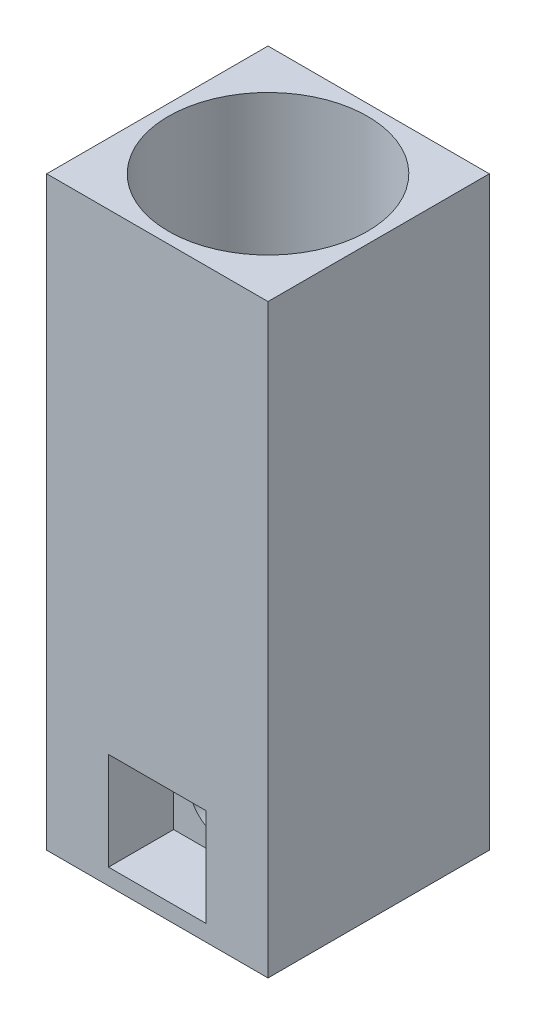
ISO-10303-21;
HEADER;
FILE_DESCRIPTION(('STEP AP214'),'2;1');
FILE_NAME('part.step','',(''),(''),'','','');
FILE_SCHEMA(('AUTOMOTIVE_DESIGN { 1 0 10303 214 1 1 1 1 }'));
ENDSEC;
DATA;
#1=APPLICATION_CONTEXT('core data for automotive mechanical design processes');
#2=APPLICATION_PROTOCOL_DEFINITION('international standard','automotive_design',2000,#1);
#3=PRODUCT_CONTEXT('',#1,'mechanical');
#4=PRODUCT('Part','Part','',(#3));
#5=PRODUCT_RELATED_PRODUCT_CATEGORY('part','',(#4));
#6=PRODUCT_DEFINITION_FORMATION('','',#4);
#7=PRODUCT_DEFINITION_CONTEXT('part definition',#1,'design');
#8=PRODUCT_DEFINITION('design','',#6,#7);
#9=PRODUCT_DEFINITION_SHAPE('','',#8);
#10=(LENGTH_UNIT() NAMED_UNIT(*) SI_UNIT(.MILLI.,.METRE.));
#11=(NAMED_UNIT(*) PLANE_ANGLE_UNIT() SI_UNIT($,.RADIAN.));
#12=(NAMED_UNIT(*) SI_UNIT($,.STERADIAN.) SOLID_ANGLE_UNIT());
#13=UNCERTAINTY_MEASURE_WITH_UNIT(LENGTH_MEASURE(1.E-05),#10,'distance_accuracy_value','');
#14=(GEOMETRIC_REPRESENTATION_CONTEXT(3) GLOBAL_UNCERTAINTY_ASSIGNED_CONTEXT((#13)) GLOBAL_UNIT_ASSIGNED_CONTEXT((#10,
#11,#12)) REPRESENTATION_CONTEXT('',''));
#15=CARTESIAN_POINT('',(0.,0.,0.));
#16=DIRECTION('',(0.,0.,1.));
#17=DIRECTION('',(1.,0.,0.));
#18=AXIS2_PLACEMENT_3D('',#15,#16,#17);
#19=CARTESIAN_POINT('',(10.795,57.15,10.795));
#20=DIRECTION('',(-1.,0.,0.));
#21=DIRECTION('',(0.,0.,1.));
#22=AXIS2_PLACEMENT_3D('',#19,#20,#21);
#23=PLANE('',#22);
#24=DIRECTION('',(0.,0.,-1.));
#25=VECTOR('',#24,1.);
#26=CARTESIAN_POINT('',(10.795,0.,10.795));
#27=LINE('',#26,#25);
#28=CARTESIAN_POINT('',(10.795,0.,10.795));
#29=VERTEX_POINT('',#28);
#30=CARTESIAN_POINT('',(10.795,0.,-10.795));
#31=VERTEX_POINT('',#30);
#32=EDGE_CURVE('E162',#29,#31,#27,.T.);
#33=ORIENTED_EDGE('',*,*,#32,.T.);
#34=DIRECTION('',(0.,-1.,0.));
#35=VECTOR('',#34,1.);
#36=CARTESIAN_POINT('',(10.795,57.15,-10.795));
#37=LINE('',#36,#35);
#38=CARTESIAN_POINT('',(10.795,57.15,-10.795));
#39=VERTEX_POINT('',#38);
#40=EDGE_CURVE('E11',#39,#31,#37,.T.);
#41=ORIENTED_EDGE('',*,*,#40,.F.);
#42=DIRECTION('',(0.,0.,-1.));
#43=VECTOR('',#42,1.);
#44=CARTESIAN_POINT('',(10.795,57.15,10.795));
#45=LINE('',#44,#43);
#46=CARTESIAN_POINT('',(10.795,57.15,10.795));
#47=VERTEX_POINT('',#46);
#48=EDGE_CURVE('E168',#47,#39,#45,.T.);
#49=ORIENTED_EDGE('',*,*,#48,.F.);
#50=DIRECTION('',(0.,-1.,0.));
#51=VECTOR('',#50,1.);
#52=CARTESIAN_POINT('',(10.795,57.15,10.795));
#53=LINE('',#52,#51);
#54=EDGE_CURVE('E178',#47,#29,#53,.T.);
#55=ORIENTED_EDGE('',*,*,#54,.T.);
#56=EDGE_LOOP('',(#33,#41,#49,#55));
#57=FACE_BOUND('',#56,.T.);
#58=ADVANCED_FACE('F39',(#57),#23,.F.);
#59=CARTESIAN_POINT('',(-10.795,57.15,-10.795));
#60=DIRECTION('',(0.,0.,1.));
#61=DIRECTION('',(1.,0.,0.));
#62=AXIS2_PLACEMENT_3D('',#59,#60,#61);
#63=PLANE('',#62);
#64=CARTESIAN_POINT('',(0.,6.35,-10.795));
#65=DIRECTION('',(0.,0.,1.));
#66=DIRECTION('',(1.,0.,0.));
#67=AXIS2_PLACEMENT_3D('',#64,#65,#66);
#68=CIRCLE('',#67,3.302);
#69=CARTESIAN_POINT('',(3.302,6.35,-10.795));
#70=VERTEX_POINT('',#69);
#71=EDGE_CURVE('E153',#70,#70,#68,.T.);
#72=ORIENTED_EDGE('',*,*,#71,.T.);
#73=EDGE_LOOP('',(#72));
#74=FACE_BOUND('',#73,.T.);
#75=DIRECTION('',(-1.,0.,0.));
#76=VECTOR('',#75,1.);
#77=CARTESIAN_POINT('',(-10.795,0.,-10.795));
#78=LINE('',#77,#76);
#79=CARTESIAN_POINT('',(-10.795,0.,-10.795));
#80=VERTEX_POINT('',#79);
#81=EDGE_CURVE('E182',#31,#80,#78,.T.);
#82=ORIENTED_EDGE('',*,*,#81,.T.);
#83=DIRECTION('',(0.,-1.,0.));
#84=VECTOR('',#83,1.);
#85=CARTESIAN_POINT('',(-10.795,57.15,-10.795));
#86=LINE('',#85,#84);
#87=CARTESIAN_POINT('',(-10.795,57.15,-10.795));
#88=VERTEX_POINT('',#87);
#89=EDGE_CURVE('E47',#88,#80,#86,.T.);
#90=ORIENTED_EDGE('',*,*,#89,.F.);
#91=DIRECTION('',(-1.,0.,0.));
#92=VECTOR('',#91,1.);
#93=CARTESIAN_POINT('',(-10.795,57.15,-10.795));
#94=LINE('',#93,#92);
#95=EDGE_CURVE('E91',#39,#88,#94,.T.);
#96=ORIENTED_EDGE('',*,*,#95,.F.);
#97=ORIENTED_EDGE('',*,*,#40,.T.);
#98=EDGE_LOOP('',(#82,#90,#96,#97));
#99=FACE_BOUND('',#98,.T.);
#100=ADVANCED_FACE('F218',(#74,#99),#63,.F.);
#101=CARTESIAN_POINT('',(-10.795,57.15,10.795));
#102=DIRECTION('',(1.,0.,0.));
#103=DIRECTION('',(0.,0.,-1.));
#104=AXIS2_PLACEMENT_3D('',#101,#102,#103);
#105=PLANE('',#104);
#106=DIRECTION('',(0.,0.,1.));
#107=VECTOR('',#106,1.);
#108=CARTESIAN_POINT('',(-10.795,0.,10.795));
#109=LINE('',#108,#107);
#110=CARTESIAN_POINT('',(-10.795,0.,10.795));
#111=VERTEX_POINT('',#110);
#112=EDGE_CURVE('E185',#80,#111,#109,.T.);
#113=ORIENTED_EDGE('',*,*,#112,.T.);
#114=DIRECTION('',(0.,-1.,0.));
#115=VECTOR('',#114,1.);
#116=CARTESIAN_POINT('',(-10.795,57.15,10.795));
#117=LINE('',#116,#115);
#118=CARTESIAN_POINT('',(-10.795,57.15,10.795));
#119=VERTEX_POINT('',#118);
#120=EDGE_CURVE('E192',#119,#111,#117,.T.);
#121=ORIENTED_EDGE('',*,*,#120,.F.);
#122=DIRECTION('',(0.,0.,1.));
#123=VECTOR('',#122,1.);
#124=CARTESIAN_POINT('',(-10.795,57.15,10.795));
#125=LINE('',#124,#123);
#126=EDGE_CURVE('E173',#88,#119,#125,.T.);
#127=ORIENTED_EDGE('',*,*,#126,.F.);
#128=ORIENTED_EDGE('',*,*,#89,.T.);
#129=EDGE_LOOP('',(#113,#121,#127,#128));
#130=FACE_BOUND('',#129,.T.);
#131=ADVANCED_FACE('F199',(#130),#105,.F.);
#132=CARTESIAN_POINT('',(-10.795,57.15,10.795));
#133=DIRECTION('',(0.,0.,-1.));
#134=DIRECTION('',(-1.,0.,0.));
#135=AXIS2_PLACEMENT_3D('',#132,#133,#134);
#136=PLANE('',#135);
#137=DIRECTION('',(-1.,0.,0.));
#138=VECTOR('',#137,1.);
#139=CARTESIAN_POINT('',(-4.7625,11.1125,10.795));
#140=LINE('',#139,#138);
#141=CARTESIAN_POINT('',(4.7625,11.1125,10.795));
#142=VERTEX_POINT('',#141);
#143=CARTESIAN_POINT('',(-4.7625,11.1125,10.795));
#144=VERTEX_POINT('',#143);
#145=EDGE_CURVE('E152',#142,#144,#140,.T.);
#146=ORIENTED_EDGE('',*,*,#145,.F.);
#147=DIRECTION('',(0.,1.,0.));
#148=VECTOR('',#147,1.);
#149=CARTESIAN_POINT('',(4.7625,1.5875,10.795));
#150=LINE('',#149,#148);
#151=CARTESIAN_POINT('',(4.7625,1.5875,10.795));
#152=VERTEX_POINT('',#151);
#153=EDGE_CURVE('E54',#152,#142,#150,.T.);
#154=ORIENTED_EDGE('',*,*,#153,.F.);
#155=DIRECTION('',(1.,0.,0.));
#156=VECTOR('',#155,1.);
#157=CARTESIAN_POINT('',(-4.7625,1.5875,10.795));
#158=LINE('',#157,#156);
#159=CARTESIAN_POINT('',(-4.7625,1.5875,10.795));
#160=VERTEX_POINT('',#159);
#161=EDGE_CURVE('E136',#160,#152,#158,.T.);
#162=ORIENTED_EDGE('',*,*,#161,.F.);
#163=DIRECTION('',(0.,-1.,0.));
#164=VECTOR('',#163,1.);
#165=CARTESIAN_POINT('',(-4.7625,1.5875,10.795));
#166=LINE('',#165,#164);
#167=EDGE_CURVE('E140',#144,#160,#166,.T.);
#168=ORIENTED_EDGE('',*,*,#167,.F.);
#169=EDGE_LOOP('',(#146,#154,#162,#168));
#170=FACE_BOUND('',#169,.T.);
#171=DIRECTION('',(1.,0.,0.));
#172=VECTOR('',#171,1.);
#173=CARTESIAN_POINT('',(-10.795,0.,10.795));
#174=LINE('',#173,#172);
#175=EDGE_CURVE('E84',#111,#29,#174,.T.);
#176=ORIENTED_EDGE('',*,*,#175,.T.);
#177=ORIENTED_EDGE('',*,*,#54,.F.);
#178=DIRECTION('',(1.,0.,0.));
#179=VECTOR('',#178,1.);
#180=CARTESIAN_POINT('',(-10.795,57.15,10.795));
#181=LINE('',#180,#179);
#182=EDGE_CURVE('E63',#119,#47,#181,.T.);
#183=ORIENTED_EDGE('',*,*,#182,.F.);
#184=ORIENTED_EDGE('',*,*,#120,.T.);
#185=EDGE_LOOP('',(#176,#177,#183,#184));
#186=FACE_BOUND('',#185,.T.);
#187=ADVANCED_FACE('F207',(#170,#186),#136,.F.);
#188=CARTESIAN_POINT('',(0.,57.15,0.));
#189=DIRECTION('',(0.,-1.,0.));
#190=DIRECTION('',(0.,0.,-1.));
#191=AXIS2_PLACEMENT_3D('',#188,#189,#190);
#192=PLANE('',#191);
#193=CARTESIAN_POINT('',(0.,57.15,0.));
#194=DIRECTION('',(0.,1.,0.));
#195=DIRECTION('',(0.,0.,1.));
#196=AXIS2_PLACEMENT_3D('',#193,#194,#195);
#197=CIRCLE('',#196,9.7155);
#198=CARTESIAN_POINT('',(0.,57.15,9.7155));
#199=VERTEX_POINT('',#198);
#200=EDGE_CURVE('E236',#199,#199,#197,.T.);
#201=ORIENTED_EDGE('',*,*,#200,.F.);
#202=EDGE_LOOP('',(#201));
#203=FACE_BOUND('',#202,.T.);
#204=ORIENTED_EDGE('',*,*,#48,.T.);
#205=ORIENTED_EDGE('',*,*,#95,.T.);
#206=ORIENTED_EDGE('',*,*,#126,.T.);
#207=ORIENTED_EDGE('',*,*,#182,.T.);
#208=EDGE_LOOP('',(#204,#205,#206,#207));
#209=FACE_BOUND('',#208,.T.);
#210=ADVANCED_FACE('F209',(#203,#209),#192,.F.);
#211=CARTESIAN_POINT('',(0.,0.,0.));
#212=DIRECTION('',(0.,-1.,0.));
#213=DIRECTION('',(0.,0.,-1.));
#214=AXIS2_PLACEMENT_3D('',#211,#212,#213);
#215=PLANE('',#214);
#216=ORIENTED_EDGE('',*,*,#32,.F.);
#217=ORIENTED_EDGE('',*,*,#175,.F.);
#218=ORIENTED_EDGE('',*,*,#112,.F.);
#219=ORIENTED_EDGE('',*,*,#81,.F.);
#220=EDGE_LOOP('',(#216,#217,#218,#219));
#221=FACE_BOUND('',#220,.T.);
#222=ADVANCED_FACE('F203',(#221),#215,.T.);
#223=CARTESIAN_POINT('',(4.7625,1.5875,4.445));
#224=DIRECTION('',(1.,0.,0.));
#225=DIRECTION('',(0.,0.,-1.));
#226=AXIS2_PLACEMENT_3D('',#223,#224,#225);
#227=PLANE('',#226);
#228=ORIENTED_EDGE('',*,*,#153,.T.);
#229=DIRECTION('',(0.,0.,1.));
#230=VECTOR('',#229,1.);
#231=CARTESIAN_POINT('',(4.7625,11.1125,4.445));
#232=LINE('',#231,#230);
#233=CARTESIAN_POINT('',(4.7625,11.1125,4.445));
#234=VERTEX_POINT('',#233);
#235=EDGE_CURVE('E111',#234,#142,#232,.T.);
#236=ORIENTED_EDGE('',*,*,#235,.F.);
#237=DIRECTION('',(0.,1.,0.));
#238=VECTOR('',#237,1.);
#239=CARTESIAN_POINT('',(4.7625,1.5875,4.445));
#240=LINE('',#239,#238);
#241=CARTESIAN_POINT('',(4.7625,1.5875,4.445));
#242=VERTEX_POINT('',#241);
#243=EDGE_CURVE('E115',#242,#234,#240,.T.);
#244=ORIENTED_EDGE('',*,*,#243,.F.);
#245=DIRECTION('',(0.,0.,1.));
#246=VECTOR('',#245,1.);
#247=CARTESIAN_POINT('',(4.7625,1.5875,4.445));
#248=LINE('',#247,#246);
#249=EDGE_CURVE('E159',#242,#152,#248,.T.);
#250=ORIENTED_EDGE('',*,*,#249,.T.);
#251=EDGE_LOOP('',(#228,#236,#244,#250));
#252=FACE_BOUND('',#251,.T.);
#253=ADVANCED_FACE('F113',(#252),#227,.F.);
#254=CARTESIAN_POINT('',(-4.7625,1.5875,4.445));
#255=DIRECTION('',(0.,-1.,0.));
#256=DIRECTION('',(1.,0.,0.));
#257=AXIS2_PLACEMENT_3D('',#254,#255,#256);
#258=PLANE('',#257);
#259=ORIENTED_EDGE('',*,*,#161,.T.);
#260=ORIENTED_EDGE('',*,*,#249,.F.);
#261=DIRECTION('',(1.,0.,0.));
#262=VECTOR('',#261,1.);
#263=CARTESIAN_POINT('',(-4.7625,1.5875,4.445));
#264=LINE('',#263,#262);
#265=CARTESIAN_POINT('',(-4.7625,1.5875,4.445));
#266=VERTEX_POINT('',#265);
#267=EDGE_CURVE('E122',#266,#242,#264,.T.);
#268=ORIENTED_EDGE('',*,*,#267,.F.);
#269=DIRECTION('',(0.,0.,1.));
#270=VECTOR('',#269,1.);
#271=CARTESIAN_POINT('',(-4.7625,1.5875,4.445));
#272=LINE('',#271,#270);
#273=EDGE_CURVE('E163',#266,#160,#272,.T.);
#274=ORIENTED_EDGE('',*,*,#273,.T.);
#275=EDGE_LOOP('',(#259,#260,#268,#274));
#276=FACE_BOUND('',#275,.T.);
#277=ADVANCED_FACE('F262',(#276),#258,.F.);
#278=CARTESIAN_POINT('',(-4.7625,1.5875,4.445));
#279=DIRECTION('',(-1.,0.,0.));
#280=DIRECTION('',(0.,0.,1.));
#281=AXIS2_PLACEMENT_3D('',#278,#279,#280);
#282=PLANE('',#281);
#283=ORIENTED_EDGE('',*,*,#167,.T.);
#284=ORIENTED_EDGE('',*,*,#273,.F.);
#285=DIRECTION('',(0.,-1.,0.));
#286=VECTOR('',#285,1.);
#287=CARTESIAN_POINT('',(-4.7625,1.5875,4.445));
#288=LINE('',#287,#286);
#289=CARTESIAN_POINT('',(-4.7625,11.1125,4.445));
#290=VERTEX_POINT('',#289);
#291=EDGE_CURVE('E131',#290,#266,#288,.T.);
#292=ORIENTED_EDGE('',*,*,#291,.F.);
#293=DIRECTION('',(0.,0.,1.));
#294=VECTOR('',#293,1.);
#295=CARTESIAN_POINT('',(-4.7625,11.1125,4.445));
#296=LINE('',#295,#294);
#297=EDGE_CURVE('E121',#290,#144,#296,.T.);
#298=ORIENTED_EDGE('',*,*,#297,.T.);
#299=EDGE_LOOP('',(#283,#284,#292,#298));
#300=FACE_BOUND('',#299,.T.);
#301=ADVANCED_FACE('F265',(#300),#282,.F.);
#302=CARTESIAN_POINT('',(-4.7625,11.1125,4.445));
#303=DIRECTION('',(0.,1.,0.));
#304=DIRECTION('',(0.,0.,1.));
#305=AXIS2_PLACEMENT_3D('',#302,#303,#304);
#306=PLANE('',#305);
#307=ORIENTED_EDGE('',*,*,#145,.T.);
#308=ORIENTED_EDGE('',*,*,#297,.F.);
#309=DIRECTION('',(-1.,0.,0.));
#310=VECTOR('',#309,1.);
#311=CARTESIAN_POINT('',(-4.7625,11.1125,4.445));
#312=LINE('',#311,#310);
#313=EDGE_CURVE('E125',#234,#290,#312,.T.);
#314=ORIENTED_EDGE('',*,*,#313,.F.);
#315=ORIENTED_EDGE('',*,*,#235,.T.);
#316=EDGE_LOOP('',(#307,#308,#314,#315));
#317=FACE_BOUND('',#316,.T.);
#318=ADVANCED_FACE('F126',(#317),#306,.F.);
#319=CARTESIAN_POINT('',(0.,0.,4.445));
#320=DIRECTION('',(0.,0.,-1.));
#321=DIRECTION('',(-1.,0.,0.));
#322=AXIS2_PLACEMENT_3D('',#319,#320,#321);
#323=PLANE('',#322);
#324=CARTESIAN_POINT('',(0.,6.35,4.445));
#325=DIRECTION('',(0.,0.,1.));
#326=DIRECTION('',(1.,0.,0.));
#327=AXIS2_PLACEMENT_3D('',#324,#325,#326);
#328=CIRCLE('',#327,3.302);
#329=CARTESIAN_POINT('',(3.302,6.35,4.445));
#330=VERTEX_POINT('',#329);
#331=EDGE_CURVE('E143',#330,#330,#328,.T.);
#332=ORIENTED_EDGE('',*,*,#331,.F.);
#333=EDGE_LOOP('',(#332));
#334=FACE_BOUND('',#333,.T.);
#335=ORIENTED_EDGE('',*,*,#243,.T.);
#336=ORIENTED_EDGE('',*,*,#313,.T.);
#337=ORIENTED_EDGE('',*,*,#291,.T.);
#338=ORIENTED_EDGE('',*,*,#267,.T.);
#339=EDGE_LOOP('',(#335,#336,#337,#338));
#340=FACE_BOUND('',#339,.T.);
#341=ADVANCED_FACE('F133',(#334,#340),#323,.F.);
#342=CARTESIAN_POINT('',(0.,6.35,-10.795));
#343=DIRECTION('',(0.,0.,1.));
#344=DIRECTION('',(1.,0.,0.));
#345=AXIS2_PLACEMENT_3D('',#342,#343,#344);
#346=CYLINDRICAL_SURFACE('',#345,3.302);
#347=ORIENTED_EDGE('',*,*,#71,.F.);
#348=EDGE_LOOP('',(#347));
#349=FACE_BOUND('',#348,.T.);
#350=ORIENTED_EDGE('',*,*,#331,.T.);
#351=EDGE_LOOP('',(#350));
#352=FACE_BOUND('',#351,.T.);
#353=ADVANCED_FACE('F249',(#349,#352),#346,.F.);
#354=CARTESIAN_POINT('',(0.,25.4,0.));
#355=DIRECTION('',(0.,1.,0.));
#356=DIRECTION('',(0.,0.,1.));
#357=AXIS2_PLACEMENT_3D('',#354,#355,#356);
#358=CYLINDRICAL_SURFACE('',#357,9.7155);
#359=CARTESIAN_POINT('',(0.,25.4,0.));
#360=DIRECTION('',(0.,1.,0.));
#361=DIRECTION('',(0.,0.,1.));
#362=AXIS2_PLACEMENT_3D('',#359,#360,#361);
#363=CIRCLE('',#362,9.7155);
#364=CARTESIAN_POINT('',(0.,25.4,9.7155));
#365=VERTEX_POINT('',#364);
#366=EDGE_CURVE('E234',#365,#365,#363,.T.);
#367=ORIENTED_EDGE('',*,*,#366,.F.);
#368=EDGE_LOOP('',(#367));
#369=FACE_BOUND('',#368,.T.);
#370=ORIENTED_EDGE('',*,*,#200,.T.);
#371=EDGE_LOOP('',(#370));
#372=FACE_BOUND('',#371,.T.);
#373=ADVANCED_FACE('F246',(#369,#372),#358,.F.);
#374=CARTESIAN_POINT('',(0.,25.4,0.));
#375=DIRECTION('',(0.,1.,0.));
#376=DIRECTION('',(0.,0.,1.));
#377=AXIS2_PLACEMENT_3D('',#374,#375,#376);
#378=PLANE('',#377);
#379=ORIENTED_EDGE('',*,*,#366,.T.);
#380=EDGE_LOOP('',(#379));
#381=FACE_BOUND('',#380,.T.);
#382=ADVANCED_FACE('F244',(#381),#378,.T.);
#383=CLOSED_SHELL('',(#58,#100,#131,#187,#210,#222,#253,#277,#301,#318,#341,#353,#373,#382));
#384=MANIFOLD_SOLID_BREP('B2',#383);
#385=ADVANCED_BREP_SHAPE_REPRESENTATION('',(#18,#384),#14);
#386=SHAPE_DEFINITION_REPRESENTATION(#9,#385);
ENDSEC;
END-ISO-10303-21;
